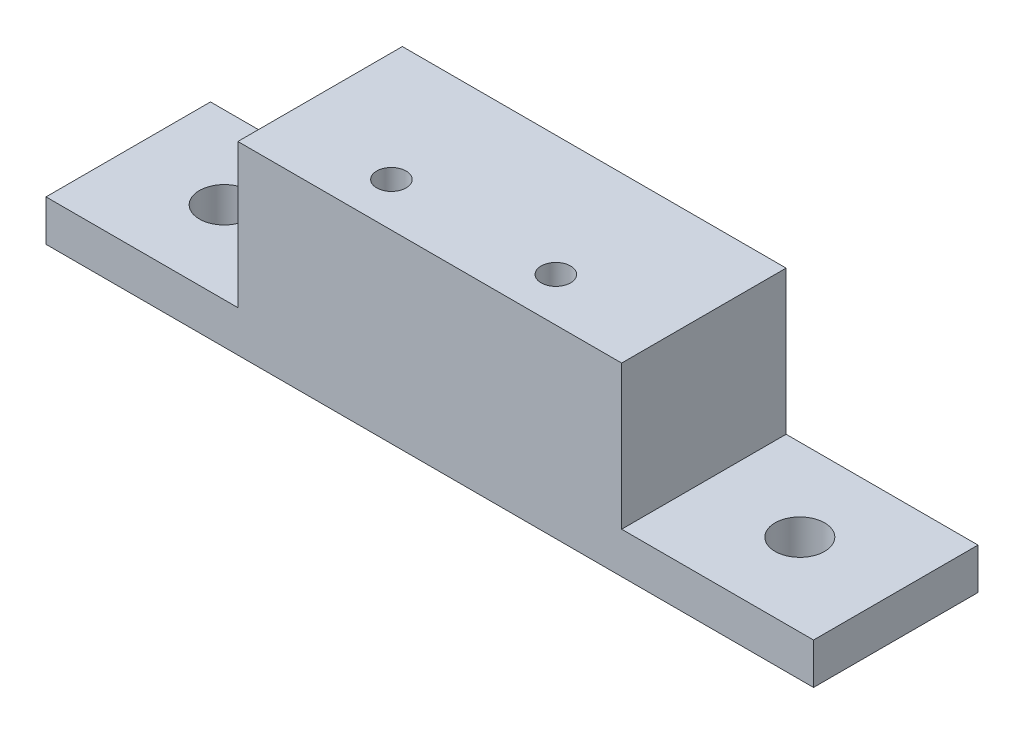
ISO-10303-21;
HEADER;
FILE_DESCRIPTION(('STEP AP214'),'2;1');
FILE_NAME('part.step','',(''),(''),'','','');
FILE_SCHEMA(('AUTOMOTIVE_DESIGN { 1 0 10303 214 1 1 1 1 }'));
ENDSEC;
DATA;
#1=APPLICATION_CONTEXT('core data for automotive mechanical design processes');
#2=APPLICATION_PROTOCOL_DEFINITION('international standard','automotive_design',2000,#1);
#3=PRODUCT_CONTEXT('',#1,'mechanical');
#4=PRODUCT('Part','Part','',(#3));
#5=PRODUCT_RELATED_PRODUCT_CATEGORY('part','',(#4));
#6=PRODUCT_DEFINITION_FORMATION('','',#4);
#7=PRODUCT_DEFINITION_CONTEXT('part definition',#1,'design');
#8=PRODUCT_DEFINITION('design','',#6,#7);
#9=PRODUCT_DEFINITION_SHAPE('','',#8);
#10=(LENGTH_UNIT() NAMED_UNIT(*) SI_UNIT(.MILLI.,.METRE.));
#11=(NAMED_UNIT(*) PLANE_ANGLE_UNIT() SI_UNIT($,.RADIAN.));
#12=(NAMED_UNIT(*) SI_UNIT($,.STERADIAN.) SOLID_ANGLE_UNIT());
#13=UNCERTAINTY_MEASURE_WITH_UNIT(LENGTH_MEASURE(1.E-05),#10,'distance_accuracy_value','');
#14=(GEOMETRIC_REPRESENTATION_CONTEXT(3) GLOBAL_UNCERTAINTY_ASSIGNED_CONTEXT((#13)) GLOBAL_UNIT_ASSIGNED_CONTEXT((#10,
#11,#12)) REPRESENTATION_CONTEXT('',''));
#15=CARTESIAN_POINT('',(0.,0.,0.));
#16=DIRECTION('',(0.,0.,1.));
#17=DIRECTION('',(1.,0.,0.));
#18=AXIS2_PLACEMENT_3D('',#15,#16,#17);
#19=CARTESIAN_POINT('',(-22.225,2.38124999999999,4.7625));
#20=DIRECTION('',(1.,0.,0.));
#21=DIRECTION('',(0.,0.,-1.));
#22=AXIS2_PLACEMENT_3D('',#19,#20,#21);
#23=PLANE('',#22);
#24=DIRECTION('',(0.,0.,-1.));
#25=VECTOR('',#24,1.);
#26=CARTESIAN_POINT('',(-22.225,2.38124999999999,4.7625));
#27=LINE('',#26,#25);
#28=CARTESIAN_POINT('',(-22.225,2.38124999999999,4.7625));
#29=VERTEX_POINT('',#28);
#30=CARTESIAN_POINT('',(-22.225,2.38124999999999,-4.7625));
#31=VERTEX_POINT('',#30);
#32=EDGE_CURVE('E442',#29,#31,#27,.T.);
#33=ORIENTED_EDGE('',*,*,#32,.T.);
#34=DIRECTION('',(0.,-1.,0.));
#35=VECTOR('',#34,1.);
#36=CARTESIAN_POINT('',(-22.225,2.38124999999999,-4.7625));
#37=LINE('',#36,#35);
#38=CARTESIAN_POINT('',(-22.225,0.,-4.7625));
#39=VERTEX_POINT('',#38);
#40=EDGE_CURVE('E436',#31,#39,#37,.T.);
#41=ORIENTED_EDGE('',*,*,#40,.T.);
#42=DIRECTION('',(0.,0.,-1.));
#43=VECTOR('',#42,1.);
#44=CARTESIAN_POINT('',(-22.225,0.,4.7625));
#45=LINE('',#44,#43);
#46=CARTESIAN_POINT('',(-22.225,0.,4.7625));
#47=VERTEX_POINT('',#46);
#48=EDGE_CURVE('E11',#47,#39,#45,.T.);
#49=ORIENTED_EDGE('',*,*,#48,.F.);
#50=DIRECTION('',(0.,-1.,0.));
#51=VECTOR('',#50,1.);
#52=CARTESIAN_POINT('',(-22.225,2.38124999999999,4.7625));
#53=LINE('',#52,#51);
#54=EDGE_CURVE('E465',#29,#47,#53,.T.);
#55=ORIENTED_EDGE('',*,*,#54,.F.);
#56=EDGE_LOOP('',(#33,#41,#49,#55));
#57=FACE_BOUND('',#56,.T.);
#58=ADVANCED_FACE('F360',(#57),#23,.F.);
#59=CARTESIAN_POINT('',(-22.225,0.,4.7625));
#60=DIRECTION('',(0.,1.,0.));
#61=DIRECTION('',(0.,0.,1.));
#62=AXIS2_PLACEMENT_3D('',#59,#60,#61);
#63=PLANE('',#62);
#64=CARTESIAN_POINT('',(-16.66875,0.,0.));
#65=DIRECTION('',(0.,1.,0.));
#66=DIRECTION('',(1.,0.,0.));
#67=AXIS2_PLACEMENT_3D('',#64,#65,#66);
#68=CIRCLE('',#67,1.4351);
#69=CARTESIAN_POINT('',(-15.23365,0.,0.));
#70=VERTEX_POINT('',#69);
#71=EDGE_CURVE('E565',#70,#70,#68,.T.);
#72=ORIENTED_EDGE('',*,*,#71,.T.);
#73=EDGE_LOOP('',(#72));
#74=FACE_BOUND('',#73,.T.);
#75=CARTESIAN_POINT('',(16.66875,0.,0.));
#76=DIRECTION('',(0.,1.,0.));
#77=DIRECTION('',(-1.,0.,0.));
#78=AXIS2_PLACEMENT_3D('',#75,#76,#77);
#79=CIRCLE('',#78,1.4351);
#80=CARTESIAN_POINT('',(15.23365,0.,0.));
#81=VERTEX_POINT('',#80);
#82=EDGE_CURVE('E559',#81,#81,#79,.T.);
#83=ORIENTED_EDGE('',*,*,#82,.T.);
#84=EDGE_LOOP('',(#83));
#85=FACE_BOUND('',#84,.T.);
#86=CARTESIAN_POINT('',(4.7625,0.,2.2225));
#87=DIRECTION('',(0.,1.,0.));
#88=DIRECTION('',(-1.,0.,0.));
#89=AXIS2_PLACEMENT_3D('',#86,#87,#88);
#90=CIRCLE('',#89,0.8509);
#91=CARTESIAN_POINT('',(3.9116,0.,2.2225));
#92=VERTEX_POINT('',#91);
#93=EDGE_CURVE('E554',#92,#92,#90,.T.);
#94=ORIENTED_EDGE('',*,*,#93,.T.);
#95=EDGE_LOOP('',(#94));
#96=FACE_BOUND('',#95,.T.);
#97=CARTESIAN_POINT('',(-4.7625,0.,2.2225));
#98=DIRECTION('',(0.,1.,0.));
#99=DIRECTION('',(-1.,0.,0.));
#100=AXIS2_PLACEMENT_3D('',#97,#98,#99);
#101=CIRCLE('',#100,0.8509);
#102=CARTESIAN_POINT('',(-5.6134,0.,2.2225));
#103=VERTEX_POINT('',#102);
#104=EDGE_CURVE('E443',#103,#103,#101,.T.);
#105=ORIENTED_EDGE('',*,*,#104,.T.);
#106=EDGE_LOOP('',(#105));
#107=FACE_BOUND('',#106,.T.);
#108=ORIENTED_EDGE('',*,*,#48,.T.);
#109=DIRECTION('',(1.,0.,0.));
#110=VECTOR('',#109,1.);
#111=CARTESIAN_POINT('',(-22.225,0.,-4.7625));
#112=LINE('',#111,#110);
#113=CARTESIAN_POINT('',(22.225,0.,-4.7625));
#114=VERTEX_POINT('',#113);
#115=EDGE_CURVE('E426',#39,#114,#112,.T.);
#116=ORIENTED_EDGE('',*,*,#115,.T.);
#117=DIRECTION('',(0.,0.,-1.));
#118=VECTOR('',#117,1.);
#119=CARTESIAN_POINT('',(22.225,0.,4.7625));
#120=LINE('',#119,#118);
#121=CARTESIAN_POINT('',(22.225,0.,4.7625));
#122=VERTEX_POINT('',#121);
#123=EDGE_CURVE('E367',#122,#114,#120,.T.);
#124=ORIENTED_EDGE('',*,*,#123,.F.);
#125=DIRECTION('',(1.,0.,0.));
#126=VECTOR('',#125,1.);
#127=CARTESIAN_POINT('',(-22.225,0.,4.7625));
#128=LINE('',#127,#126);
#129=EDGE_CURVE('E427',#47,#122,#128,.T.);
#130=ORIENTED_EDGE('',*,*,#129,.F.);
#131=EDGE_LOOP('',(#108,#116,#124,#130));
#132=FACE_BOUND('',#131,.T.);
#133=ADVANCED_FACE('F424',(#74,#85,#96,#107,#132),#63,.F.);
#134=CARTESIAN_POINT('',(22.225,0.,4.7625));
#135=DIRECTION('',(-1.,0.,0.));
#136=DIRECTION('',(0.,0.,1.));
#137=AXIS2_PLACEMENT_3D('',#134,#135,#136);
#138=PLANE('',#137);
#139=ORIENTED_EDGE('',*,*,#123,.T.);
#140=DIRECTION('',(0.,1.,0.));
#141=VECTOR('',#140,1.);
#142=CARTESIAN_POINT('',(22.225,0.,-4.7625));
#143=LINE('',#142,#141);
#144=CARTESIAN_POINT('',(22.225,2.38125,-4.7625));
#145=VERTEX_POINT('',#144);
#146=EDGE_CURVE('E440',#114,#145,#143,.T.);
#147=ORIENTED_EDGE('',*,*,#146,.T.);
#148=DIRECTION('',(0.,0.,-1.));
#149=VECTOR('',#148,1.);
#150=CARTESIAN_POINT('',(22.225,2.38125,4.7625));
#151=LINE('',#150,#149);
#152=CARTESIAN_POINT('',(22.225,2.38125,4.7625));
#153=VERTEX_POINT('',#152);
#154=EDGE_CURVE('E487',#153,#145,#151,.T.);
#155=ORIENTED_EDGE('',*,*,#154,.F.);
#156=DIRECTION('',(0.,1.,0.));
#157=VECTOR('',#156,1.);
#158=CARTESIAN_POINT('',(22.225,0.,4.7625));
#159=LINE('',#158,#157);
#160=EDGE_CURVE('E468',#122,#153,#159,.T.);
#161=ORIENTED_EDGE('',*,*,#160,.F.);
#162=EDGE_LOOP('',(#139,#147,#155,#161));
#163=FACE_BOUND('',#162,.T.);
#164=ADVANCED_FACE('F490',(#163),#138,.F.);
#165=CARTESIAN_POINT('',(22.225,2.38125,4.7625));
#166=DIRECTION('',(0.,-1.,0.));
#167=DIRECTION('',(1.,0.,0.));
#168=AXIS2_PLACEMENT_3D('',#165,#166,#167);
#169=PLANE('',#168);
#170=CARTESIAN_POINT('',(16.66875,2.38125,0.));
#171=DIRECTION('',(0.,1.,0.));
#172=DIRECTION('',(-1.,0.,0.));
#173=AXIS2_PLACEMENT_3D('',#170,#171,#172);
#174=CIRCLE('',#173,1.4351);
#175=CARTESIAN_POINT('',(15.23365,2.38125,0.));
#176=VERTEX_POINT('',#175);
#177=EDGE_CURVE('E562',#176,#176,#174,.T.);
#178=ORIENTED_EDGE('',*,*,#177,.F.);
#179=EDGE_LOOP('',(#178));
#180=FACE_BOUND('',#179,.T.);
#181=ORIENTED_EDGE('',*,*,#154,.T.);
#182=DIRECTION('',(-1.,0.,0.));
#183=VECTOR('',#182,1.);
#184=CARTESIAN_POINT('',(22.225,2.38125,-4.7625));
#185=LINE('',#184,#183);
#186=CARTESIAN_POINT('',(11.1125,2.38125,-4.7625));
#187=VERTEX_POINT('',#186);
#188=EDGE_CURVE('E451',#145,#187,#185,.T.);
#189=ORIENTED_EDGE('',*,*,#188,.T.);
#190=DIRECTION('',(0.,0.,-1.));
#191=VECTOR('',#190,1.);
#192=CARTESIAN_POINT('',(11.1125,2.38125,4.7625));
#193=LINE('',#192,#191);
#194=CARTESIAN_POINT('',(11.1125,2.38125,4.7625));
#195=VERTEX_POINT('',#194);
#196=EDGE_CURVE('E485',#195,#187,#193,.T.);
#197=ORIENTED_EDGE('',*,*,#196,.F.);
#198=DIRECTION('',(-1.,0.,0.));
#199=VECTOR('',#198,1.);
#200=CARTESIAN_POINT('',(22.225,2.38125,4.7625));
#201=LINE('',#200,#199);
#202=EDGE_CURVE('E470',#153,#195,#201,.T.);
#203=ORIENTED_EDGE('',*,*,#202,.F.);
#204=EDGE_LOOP('',(#181,#189,#197,#203));
#205=FACE_BOUND('',#204,.T.);
#206=ADVANCED_FACE('F498',(#180,#205),#169,.F.);
#207=CARTESIAN_POINT('',(11.1125,2.38125,4.7625));
#208=DIRECTION('',(-1.,0.,0.));
#209=DIRECTION('',(0.,0.,1.));
#210=AXIS2_PLACEMENT_3D('',#207,#208,#209);
#211=PLANE('',#210);
#212=ORIENTED_EDGE('',*,*,#196,.T.);
#213=DIRECTION('',(0.,1.,0.));
#214=VECTOR('',#213,1.);
#215=CARTESIAN_POINT('',(11.1125,2.38125,-4.7625));
#216=LINE('',#215,#214);
#217=CARTESIAN_POINT('',(11.1125,10.715625,-4.7625));
#218=VERTEX_POINT('',#217);
#219=EDGE_CURVE('E454',#187,#218,#216,.T.);
#220=ORIENTED_EDGE('',*,*,#219,.T.);
#221=DIRECTION('',(0.,0.,-1.));
#222=VECTOR('',#221,1.);
#223=CARTESIAN_POINT('',(11.1125,10.715625,4.7625));
#224=LINE('',#223,#222);
#225=CARTESIAN_POINT('',(11.1125,10.715625,4.7625));
#226=VERTEX_POINT('',#225);
#227=EDGE_CURVE('E483',#226,#218,#224,.T.);
#228=ORIENTED_EDGE('',*,*,#227,.F.);
#229=DIRECTION('',(0.,1.,0.));
#230=VECTOR('',#229,1.);
#231=CARTESIAN_POINT('',(11.1125,2.38125,4.7625));
#232=LINE('',#231,#230);
#233=EDGE_CURVE('E472',#195,#226,#232,.T.);
#234=ORIENTED_EDGE('',*,*,#233,.F.);
#235=EDGE_LOOP('',(#212,#220,#228,#234));
#236=FACE_BOUND('',#235,.T.);
#237=ADVANCED_FACE('F501',(#236),#211,.F.);
#238=CARTESIAN_POINT('',(11.1125,10.715625,4.7625));
#239=DIRECTION('',(0.,-1.,0.));
#240=DIRECTION('',(1.,0.,0.));
#241=AXIS2_PLACEMENT_3D('',#238,#239,#240);
#242=PLANE('',#241);
#243=CARTESIAN_POINT('',(4.7625,10.715625,2.2225));
#244=DIRECTION('',(0.,1.,0.));
#245=DIRECTION('',(-1.,0.,0.));
#246=AXIS2_PLACEMENT_3D('',#243,#244,#245);
#247=CIRCLE('',#246,0.8509);
#248=CARTESIAN_POINT('',(3.9116,10.715625,2.2225));
#249=VERTEX_POINT('',#248);
#250=EDGE_CURVE('E550',#249,#249,#247,.T.);
#251=ORIENTED_EDGE('',*,*,#250,.F.);
#252=EDGE_LOOP('',(#251));
#253=FACE_BOUND('',#252,.T.);
#254=CARTESIAN_POINT('',(-4.7625,10.715625,2.2225));
#255=DIRECTION('',(0.,1.,0.));
#256=DIRECTION('',(-1.,0.,0.));
#257=AXIS2_PLACEMENT_3D('',#254,#255,#256);
#258=CIRCLE('',#257,0.8509);
#259=CARTESIAN_POINT('',(-5.6134,10.715625,2.2225));
#260=VERTEX_POINT('',#259);
#261=EDGE_CURVE('E446',#260,#260,#258,.T.);
#262=ORIENTED_EDGE('',*,*,#261,.F.);
#263=EDGE_LOOP('',(#262));
#264=FACE_BOUND('',#263,.T.);
#265=ORIENTED_EDGE('',*,*,#227,.T.);
#266=DIRECTION('',(-1.,0.,0.));
#267=VECTOR('',#266,1.);
#268=CARTESIAN_POINT('',(11.1125,10.715625,-4.7625));
#269=LINE('',#268,#267);
#270=CARTESIAN_POINT('',(-11.1125,10.715625,-4.7625));
#271=VERTEX_POINT('',#270);
#272=EDGE_CURVE('E457',#218,#271,#269,.T.);
#273=ORIENTED_EDGE('',*,*,#272,.T.);
#274=DIRECTION('',(0.,0.,-1.));
#275=VECTOR('',#274,1.);
#276=CARTESIAN_POINT('',(-11.1125,10.715625,4.7625));
#277=LINE('',#276,#275);
#278=CARTESIAN_POINT('',(-11.1125,10.715625,4.7625));
#279=VERTEX_POINT('',#278);
#280=EDGE_CURVE('E481',#279,#271,#277,.T.);
#281=ORIENTED_EDGE('',*,*,#280,.F.);
#282=DIRECTION('',(-1.,0.,0.));
#283=VECTOR('',#282,1.);
#284=CARTESIAN_POINT('',(11.1125,10.715625,4.7625));
#285=LINE('',#284,#283);
#286=EDGE_CURVE('E474',#226,#279,#285,.T.);
#287=ORIENTED_EDGE('',*,*,#286,.F.);
#288=EDGE_LOOP('',(#265,#273,#281,#287));
#289=FACE_BOUND('',#288,.T.);
#290=ADVANCED_FACE('F506',(#253,#264,#289),#242,.F.);
#291=CARTESIAN_POINT('',(-11.1125,10.715625,4.7625));
#292=DIRECTION('',(1.,0.,0.));
#293=DIRECTION('',(0.,1.,0.));
#294=AXIS2_PLACEMENT_3D('',#291,#292,#293);
#295=PLANE('',#294);
#296=ORIENTED_EDGE('',*,*,#280,.T.);
#297=DIRECTION('',(0.,-1.,0.));
#298=VECTOR('',#297,1.);
#299=CARTESIAN_POINT('',(-11.1125,10.715625,-4.7625));
#300=LINE('',#299,#298);
#301=CARTESIAN_POINT('',(-11.1125,2.38125,-4.7625));
#302=VERTEX_POINT('',#301);
#303=EDGE_CURVE('E460',#271,#302,#300,.T.);
#304=ORIENTED_EDGE('',*,*,#303,.T.);
#305=DIRECTION('',(0.,0.,-1.));
#306=VECTOR('',#305,1.);
#307=CARTESIAN_POINT('',(-11.1125,2.38125,4.7625));
#308=LINE('',#307,#306);
#309=CARTESIAN_POINT('',(-11.1125,2.38125,4.7625));
#310=VERTEX_POINT('',#309);
#311=EDGE_CURVE('E479',#310,#302,#308,.T.);
#312=ORIENTED_EDGE('',*,*,#311,.F.);
#313=DIRECTION('',(0.,-1.,0.));
#314=VECTOR('',#313,1.);
#315=CARTESIAN_POINT('',(-11.1125,10.715625,4.7625));
#316=LINE('',#315,#314);
#317=EDGE_CURVE('E379',#279,#310,#316,.T.);
#318=ORIENTED_EDGE('',*,*,#317,.F.);
#319=EDGE_LOOP('',(#296,#304,#312,#318));
#320=FACE_BOUND('',#319,.T.);
#321=ADVANCED_FACE('F509',(#320),#295,.F.);
#322=CARTESIAN_POINT('',(-11.1125,2.38125,4.7625));
#323=DIRECTION('',(0.,-1.,0.));
#324=DIRECTION('',(1.,0.,0.));
#325=AXIS2_PLACEMENT_3D('',#322,#323,#324);
#326=PLANE('',#325);
#327=CARTESIAN_POINT('',(-16.66875,2.38125,0.));
#328=DIRECTION('',(0.,1.,0.));
#329=DIRECTION('',(1.,0.,0.));
#330=AXIS2_PLACEMENT_3D('',#327,#328,#329);
#331=CIRCLE('',#330,1.4351);
#332=CARTESIAN_POINT('',(-15.23365,2.38125,0.));
#333=VERTEX_POINT('',#332);
#334=EDGE_CURVE('E567',#333,#333,#331,.T.);
#335=ORIENTED_EDGE('',*,*,#334,.F.);
#336=EDGE_LOOP('',(#335));
#337=FACE_BOUND('',#336,.T.);
#338=ORIENTED_EDGE('',*,*,#311,.T.);
#339=DIRECTION('',(-1.,0.,0.));
#340=VECTOR('',#339,1.);
#341=CARTESIAN_POINT('',(-11.1125,2.38125,-4.7625));
#342=LINE('',#341,#340);
#343=EDGE_CURVE('E463',#302,#31,#342,.T.);
#344=ORIENTED_EDGE('',*,*,#343,.T.);
#345=ORIENTED_EDGE('',*,*,#32,.F.);
#346=DIRECTION('',(-1.,0.,0.));
#347=VECTOR('',#346,1.);
#348=CARTESIAN_POINT('',(-11.1125,2.38125,4.7625));
#349=LINE('',#348,#347);
#350=EDGE_CURVE('E374',#310,#29,#349,.T.);
#351=ORIENTED_EDGE('',*,*,#350,.F.);
#352=EDGE_LOOP('',(#338,#344,#345,#351));
#353=FACE_BOUND('',#352,.T.);
#354=ADVANCED_FACE('F511',(#337,#353),#326,.F.);
#355=CARTESIAN_POINT('',(-22.225,0.,4.7625));
#356=DIRECTION('',(0.,0.,1.));
#357=DIRECTION('',(1.,0.,0.));
#358=AXIS2_PLACEMENT_3D('',#355,#356,#357);
#359=PLANE('',#358);
#360=ORIENTED_EDGE('',*,*,#54,.T.);
#361=ORIENTED_EDGE('',*,*,#129,.T.);
#362=ORIENTED_EDGE('',*,*,#160,.T.);
#363=ORIENTED_EDGE('',*,*,#202,.T.);
#364=ORIENTED_EDGE('',*,*,#233,.T.);
#365=ORIENTED_EDGE('',*,*,#286,.T.);
#366=ORIENTED_EDGE('',*,*,#317,.T.);
#367=ORIENTED_EDGE('',*,*,#350,.T.);
#368=EDGE_LOOP('',(#360,#361,#362,#363,#364,#365,#366,#367));
#369=FACE_BOUND('',#368,.T.);
#370=ADVANCED_FACE('F493',(#369),#359,.T.);
#371=CARTESIAN_POINT('',(-22.225,0.,-4.7625));
#372=DIRECTION('',(0.,0.,1.));
#373=DIRECTION('',(1.,0.,0.));
#374=AXIS2_PLACEMENT_3D('',#371,#372,#373);
#375=PLANE('',#374);
#376=ORIENTED_EDGE('',*,*,#40,.F.);
#377=ORIENTED_EDGE('',*,*,#343,.F.);
#378=ORIENTED_EDGE('',*,*,#303,.F.);
#379=ORIENTED_EDGE('',*,*,#272,.F.);
#380=ORIENTED_EDGE('',*,*,#219,.F.);
#381=ORIENTED_EDGE('',*,*,#188,.F.);
#382=ORIENTED_EDGE('',*,*,#146,.F.);
#383=ORIENTED_EDGE('',*,*,#115,.F.);
#384=EDGE_LOOP('',(#376,#377,#378,#379,#380,#381,#382,#383));
#385=FACE_BOUND('',#384,.T.);
#386=ADVANCED_FACE('F434',(#385),#375,.F.);
#387=CARTESIAN_POINT('',(-4.7625,0.,2.2225));
#388=DIRECTION('',(0.,1.,0.));
#389=DIRECTION('',(-1.,0.,0.));
#390=AXIS2_PLACEMENT_3D('',#387,#388,#389);
#391=CYLINDRICAL_SURFACE('',#390,0.8509);
#392=ORIENTED_EDGE('',*,*,#104,.F.);
#393=EDGE_LOOP('',(#392));
#394=FACE_BOUND('',#393,.T.);
#395=ORIENTED_EDGE('',*,*,#261,.T.);
#396=EDGE_LOOP('',(#395));
#397=FACE_BOUND('',#396,.T.);
#398=ADVANCED_FACE('F583',(#394,#397),#391,.F.);
#399=CARTESIAN_POINT('',(4.7625,0.,2.2225));
#400=DIRECTION('',(0.,1.,0.));
#401=DIRECTION('',(-1.,0.,0.));
#402=AXIS2_PLACEMENT_3D('',#399,#400,#401);
#403=CYLINDRICAL_SURFACE('',#402,0.8509);
#404=ORIENTED_EDGE('',*,*,#93,.F.);
#405=EDGE_LOOP('',(#404));
#406=FACE_BOUND('',#405,.T.);
#407=ORIENTED_EDGE('',*,*,#250,.T.);
#408=EDGE_LOOP('',(#407));
#409=FACE_BOUND('',#408,.T.);
#410=ADVANCED_FACE('F577',(#406,#409),#403,.F.);
#411=CARTESIAN_POINT('',(16.66875,0.,0.));
#412=DIRECTION('',(0.,1.,0.));
#413=DIRECTION('',(-1.,0.,0.));
#414=AXIS2_PLACEMENT_3D('',#411,#412,#413);
#415=CYLINDRICAL_SURFACE('',#414,1.4351);
#416=ORIENTED_EDGE('',*,*,#82,.F.);
#417=EDGE_LOOP('',(#416));
#418=FACE_BOUND('',#417,.T.);
#419=ORIENTED_EDGE('',*,*,#177,.T.);
#420=EDGE_LOOP('',(#419));
#421=FACE_BOUND('',#420,.T.);
#422=ADVANCED_FACE('F572',(#418,#421),#415,.F.);
#423=CARTESIAN_POINT('',(-16.66875,0.,0.));
#424=DIRECTION('',(0.,1.,0.));
#425=DIRECTION('',(-1.,0.,0.));
#426=AXIS2_PLACEMENT_3D('',#423,#424,#425);
#427=CYLINDRICAL_SURFACE('',#426,1.4351);
#428=ORIENTED_EDGE('',*,*,#71,.F.);
#429=EDGE_LOOP('',(#428));
#430=FACE_BOUND('',#429,.T.);
#431=ORIENTED_EDGE('',*,*,#334,.T.);
#432=EDGE_LOOP('',(#431));
#433=FACE_BOUND('',#432,.T.);
#434=ADVANCED_FACE('F570',(#430,#433),#427,.F.);
#435=CLOSED_SHELL('',(#58,#133,#164,#206,#237,#290,#321,#354,#370,#386,#398,#410,#422,#434));
#436=MANIFOLD_SOLID_BREP('B2',#435);
#437=ADVANCED_BREP_SHAPE_REPRESENTATION('',(#18,#436),#14);
#438=SHAPE_DEFINITION_REPRESENTATION(#9,#437);
ENDSEC;
END-ISO-10303-21;
